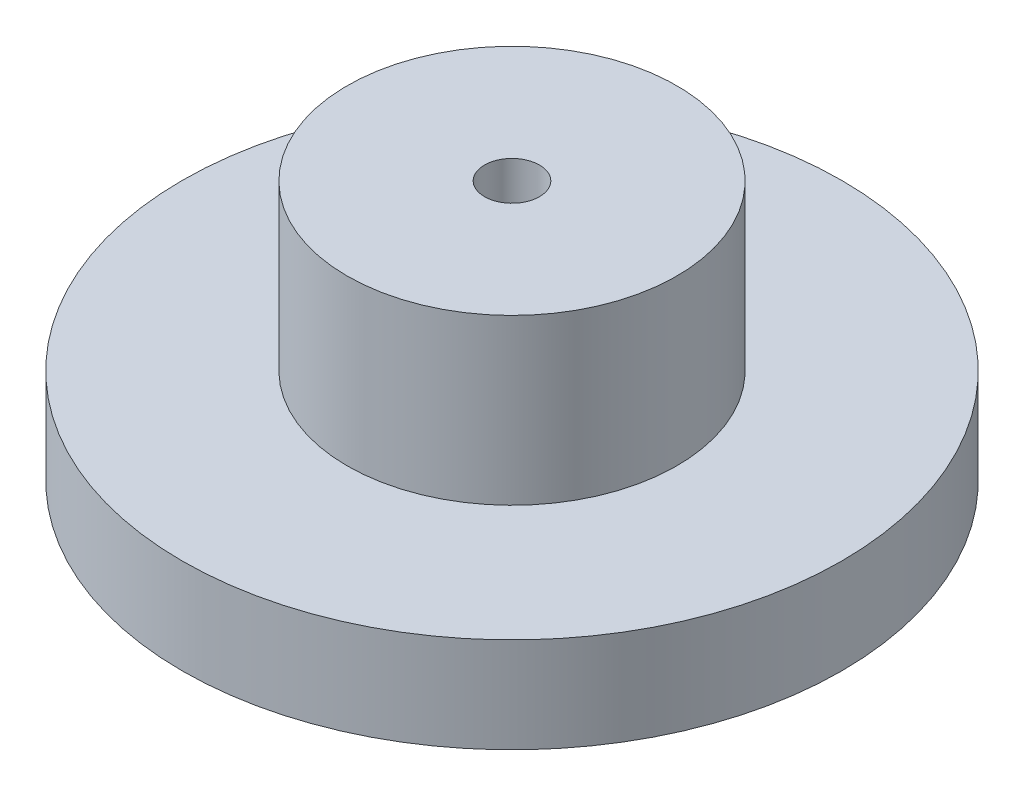
ISO-10303-21;
HEADER;
FILE_DESCRIPTION(('STEP AP214'),'2;1');
FILE_NAME('part.step','',(''),(''),'','','');
FILE_SCHEMA(('AUTOMOTIVE_DESIGN { 1 0 10303 214 1 1 1 1 }'));
ENDSEC;
DATA;
#1=APPLICATION_CONTEXT('core data for automotive mechanical design processes');
#2=APPLICATION_PROTOCOL_DEFINITION('international standard','automotive_design',2000,#1);
#3=PRODUCT_CONTEXT('',#1,'mechanical');
#4=PRODUCT('Part','Part','',(#3));
#5=PRODUCT_RELATED_PRODUCT_CATEGORY('part','',(#4));
#6=PRODUCT_DEFINITION_FORMATION('','',#4);
#7=PRODUCT_DEFINITION_CONTEXT('part definition',#1,'design');
#8=PRODUCT_DEFINITION('design','',#6,#7);
#9=PRODUCT_DEFINITION_SHAPE('','',#8);
#10=(LENGTH_UNIT() NAMED_UNIT(*) SI_UNIT(.MILLI.,.METRE.));
#11=(NAMED_UNIT(*) PLANE_ANGLE_UNIT() SI_UNIT($,.RADIAN.));
#12=(NAMED_UNIT(*) SI_UNIT($,.STERADIAN.) SOLID_ANGLE_UNIT());
#13=UNCERTAINTY_MEASURE_WITH_UNIT(LENGTH_MEASURE(1.E-05),#10,'distance_accuracy_value','');
#14=(GEOMETRIC_REPRESENTATION_CONTEXT(3) GLOBAL_UNCERTAINTY_ASSIGNED_CONTEXT((#13)) GLOBAL_UNIT_ASSIGNED_CONTEXT((#10,
#11,#12)) REPRESENTATION_CONTEXT('',''));
#15=CARTESIAN_POINT('',(0.,0.,0.));
#16=DIRECTION('',(0.,0.,1.));
#17=DIRECTION('',(1.,0.,0.));
#18=AXIS2_PLACEMENT_3D('',#15,#16,#17);
#19=CARTESIAN_POINT('',(0.,11.,0.));
#20=DIRECTION('',(0.,-1.,0.));
#21=DIRECTION('',(0.,0.,-1.));
#22=AXIS2_PLACEMENT_3D('',#19,#20,#21);
#23=CYLINDRICAL_SURFACE('',#22,38.1);
#24=CARTESIAN_POINT('',(0.,11.,0.));
#25=DIRECTION('',(0.,1.,0.));
#26=DIRECTION('',(0.,0.,1.));
#27=AXIS2_PLACEMENT_3D('',#24,#25,#26);
#28=CIRCLE('',#27,38.1);
#29=CARTESIAN_POINT('',(0.,11.,38.1));
#30=VERTEX_POINT('',#29);
#31=EDGE_CURVE('E49',#30,#30,#28,.T.);
#32=ORIENTED_EDGE('',*,*,#31,.F.);
#33=EDGE_LOOP('',(#32));
#34=FACE_BOUND('',#33,.T.);
#35=CARTESIAN_POINT('',(0.,0.,0.));
#36=DIRECTION('',(0.,1.,0.));
#37=DIRECTION('',(0.,0.,1.));
#38=AXIS2_PLACEMENT_3D('',#35,#36,#37);
#39=CIRCLE('',#38,38.1);
#40=CARTESIAN_POINT('',(0.,0.,38.1));
#41=VERTEX_POINT('',#40);
#42=EDGE_CURVE('E44',#41,#41,#39,.T.);
#43=ORIENTED_EDGE('',*,*,#42,.T.);
#44=EDGE_LOOP('',(#43));
#45=FACE_BOUND('',#44,.T.);
#46=ADVANCED_FACE('F41',(#34,#45),#23,.T.);
#47=CARTESIAN_POINT('',(0.,11.,0.));
#48=DIRECTION('',(0.,1.,0.));
#49=DIRECTION('',(0.,0.,1.));
#50=AXIS2_PLACEMENT_3D('',#47,#48,#49);
#51=PLANE('',#50);
#52=CARTESIAN_POINT('',(0.,11.,0.));
#53=DIRECTION('',(0.,1.,0.));
#54=DIRECTION('',(0.,0.,1.));
#55=AXIS2_PLACEMENT_3D('',#52,#53,#54);
#56=CIRCLE('',#55,19.05);
#57=CARTESIAN_POINT('',(0.,11.,19.05));
#58=VERTEX_POINT('',#57);
#59=EDGE_CURVE('E10',#58,#58,#56,.T.);
#60=ORIENTED_EDGE('',*,*,#59,.F.);
#61=EDGE_LOOP('',(#60));
#62=FACE_BOUND('',#61,.T.);
#63=ORIENTED_EDGE('',*,*,#31,.T.);
#64=EDGE_LOOP('',(#63));
#65=FACE_BOUND('',#64,.T.);
#66=ADVANCED_FACE('F90',(#62,#65),#51,.T.);
#67=CARTESIAN_POINT('',(0.,0.,0.));
#68=DIRECTION('',(0.,1.,0.));
#69=DIRECTION('',(0.,0.,1.));
#70=AXIS2_PLACEMENT_3D('',#67,#68,#69);
#71=PLANE('',#70);
#72=CARTESIAN_POINT('',(0.,0.,0.));
#73=DIRECTION('',(0.,1.,0.));
#74=DIRECTION('',(0.,0.,1.));
#75=AXIS2_PLACEMENT_3D('',#72,#73,#74);
#76=CIRCLE('',#75,3.175);
#77=CARTESIAN_POINT('',(0.,0.,3.175));
#78=VERTEX_POINT('',#77);
#79=EDGE_CURVE('E60',#78,#78,#76,.T.);
#80=ORIENTED_EDGE('',*,*,#79,.T.);
#81=EDGE_LOOP('',(#80));
#82=FACE_BOUND('',#81,.T.);
#83=ORIENTED_EDGE('',*,*,#42,.F.);
#84=EDGE_LOOP('',(#83));
#85=FACE_BOUND('',#84,.T.);
#86=ADVANCED_FACE('F69',(#82,#85),#71,.F.);
#87=CARTESIAN_POINT('',(0.,30.,0.));
#88=DIRECTION('',(0.,-1.,0.));
#89=DIRECTION('',(0.,0.,-1.));
#90=AXIS2_PLACEMENT_3D('',#87,#88,#89);
#91=CYLINDRICAL_SURFACE('',#90,19.05);
#92=CARTESIAN_POINT('',(0.,30.,0.));
#93=DIRECTION('',(0.,1.,0.));
#94=DIRECTION('',(0.,0.,1.));
#95=AXIS2_PLACEMENT_3D('',#92,#93,#94);
#96=CIRCLE('',#95,19.05);
#97=CARTESIAN_POINT('',(0.,30.,19.05));
#98=VERTEX_POINT('',#97);
#99=EDGE_CURVE('E56',#98,#98,#96,.T.);
#100=ORIENTED_EDGE('',*,*,#99,.F.);
#101=EDGE_LOOP('',(#100));
#102=FACE_BOUND('',#101,.T.);
#103=ORIENTED_EDGE('',*,*,#59,.T.);
#104=EDGE_LOOP('',(#103));
#105=FACE_BOUND('',#104,.T.);
#106=ADVANCED_FACE('F81',(#102,#105),#91,.T.);
#107=CARTESIAN_POINT('',(0.,30.,0.));
#108=DIRECTION('',(0.,1.,0.));
#109=DIRECTION('',(0.,0.,1.));
#110=AXIS2_PLACEMENT_3D('',#107,#108,#109);
#111=PLANE('',#110);
#112=CARTESIAN_POINT('',(0.,30.,0.));
#113=DIRECTION('',(0.,1.,0.));
#114=DIRECTION('',(0.,0.,1.));
#115=AXIS2_PLACEMENT_3D('',#112,#113,#114);
#116=CIRCLE('',#115,3.175);
#117=CARTESIAN_POINT('',(0.,30.,3.175));
#118=VERTEX_POINT('',#117);
#119=EDGE_CURVE('E61',#118,#118,#116,.T.);
#120=ORIENTED_EDGE('',*,*,#119,.F.);
#121=EDGE_LOOP('',(#120));
#122=FACE_BOUND('',#121,.T.);
#123=ORIENTED_EDGE('',*,*,#99,.T.);
#124=EDGE_LOOP('',(#123));
#125=FACE_BOUND('',#124,.T.);
#126=ADVANCED_FACE('F75',(#122,#125),#111,.T.);
#127=CARTESIAN_POINT('',(0.,0.,0.));
#128=DIRECTION('',(0.,1.,0.));
#129=DIRECTION('',(0.,0.,1.));
#130=AXIS2_PLACEMENT_3D('',#127,#128,#129);
#131=CYLINDRICAL_SURFACE('',#130,3.175);
#132=ORIENTED_EDGE('',*,*,#79,.F.);
#133=EDGE_LOOP('',(#132));
#134=FACE_BOUND('',#133,.T.);
#135=ORIENTED_EDGE('',*,*,#119,.T.);
#136=EDGE_LOOP('',(#135));
#137=FACE_BOUND('',#136,.T.);
#138=ADVANCED_FACE('F72',(#134,#137),#131,.F.);
#139=CLOSED_SHELL('',(#46,#66,#86,#106,#126,#138));
#140=MANIFOLD_SOLID_BREP('B2',#139);
#141=ADVANCED_BREP_SHAPE_REPRESENTATION('',(#18,#140),#14);
#142=SHAPE_DEFINITION_REPRESENTATION(#9,#141);
ENDSEC;
END-ISO-10303-21;
